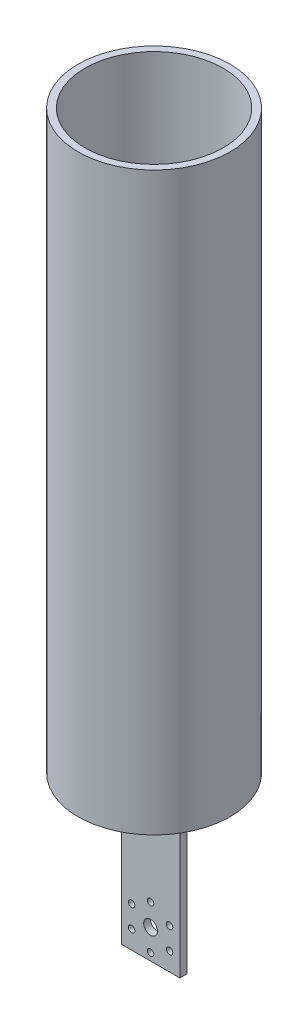
ISO-10303-21;
HEADER;
FILE_DESCRIPTION(('STEP AP214'),'2;1');
FILE_NAME('part.step','',(''),(''),'','','');
FILE_SCHEMA(('AUTOMOTIVE_DESIGN { 1 0 10303 214 1 1 1 1 }'));
ENDSEC;
DATA;
#1=APPLICATION_CONTEXT('core data for automotive mechanical design processes');
#2=APPLICATION_PROTOCOL_DEFINITION('international standard','automotive_design',2000,#1);
#3=PRODUCT_CONTEXT('',#1,'mechanical');
#4=PRODUCT('Part','Part','',(#3));
#5=PRODUCT_RELATED_PRODUCT_CATEGORY('part','',(#4));
#6=PRODUCT_DEFINITION_FORMATION('','',#4);
#7=PRODUCT_DEFINITION_CONTEXT('part definition',#1,'design');
#8=PRODUCT_DEFINITION('design','',#6,#7);
#9=PRODUCT_DEFINITION_SHAPE('','',#8);
#10=(LENGTH_UNIT() NAMED_UNIT(*) SI_UNIT(.MILLI.,.METRE.));
#11=(NAMED_UNIT(*) PLANE_ANGLE_UNIT() SI_UNIT($,.RADIAN.));
#12=(NAMED_UNIT(*) SI_UNIT($,.STERADIAN.) SOLID_ANGLE_UNIT());
#13=UNCERTAINTY_MEASURE_WITH_UNIT(LENGTH_MEASURE(1.E-05),#10,'distance_accuracy_value','');
#14=(GEOMETRIC_REPRESENTATION_CONTEXT(3) GLOBAL_UNCERTAINTY_ASSIGNED_CONTEXT((#13)) GLOBAL_UNIT_ASSIGNED_CONTEXT((#10,
#11,#12)) REPRESENTATION_CONTEXT('',''));
#15=CARTESIAN_POINT('',(0.,0.,0.));
#16=DIRECTION('',(0.,0.,1.));
#17=DIRECTION('',(1.,0.,0.));
#18=AXIS2_PLACEMENT_3D('',#15,#16,#17);
#19=CARTESIAN_POINT('',(25.4,70.,0.));
#20=DIRECTION('',(0.,0.,-1.));
#21=DIRECTION('',(0.,1.,0.));
#22=AXIS2_PLACEMENT_3D('',#19,#20,#21);
#23=PLANE('',#22);
#24=CARTESIAN_POINT('',(4.472758664048,17.4499999999997,0.));
#25=DIRECTION('',(0.,0.,1.));
#26=DIRECTION('',(1.,0.,0.));
#27=AXIS2_PLACEMENT_3D('',#24,#25,#26);
#28=CIRCLE('',#27,1.4);
#29=CARTESIAN_POINT('',(5.872758664048,17.4499999999997,0.));
#30=VERTEX_POINT('',#29);
#31=EDGE_CURVE('E142',#30,#30,#28,.T.);
#32=ORIENTED_EDGE('',*,*,#31,.F.);
#33=EDGE_LOOP('',(#32));
#34=FACE_BOUND('',#33,.T.);
#35=CARTESIAN_POINT('',(4.47275866404836,7.94999999999964,0.));
#36=DIRECTION('',(0.,0.,1.));
#37=DIRECTION('',(1.,0.,0.));
#38=AXIS2_PLACEMENT_3D('',#35,#36,#37);
#39=CIRCLE('',#38,1.4);
#40=CARTESIAN_POINT('',(5.87275866404836,7.94999999999964,0.));
#41=VERTEX_POINT('',#40);
#42=EDGE_CURVE('E146',#41,#41,#39,.T.);
#43=ORIENTED_EDGE('',*,*,#42,.F.);
#44=EDGE_LOOP('',(#43));
#45=FACE_BOUND('',#44,.T.);
#46=CARTESIAN_POINT('',(12.7000000000007,3.19999999999995,0.));
#47=DIRECTION('',(0.,0.,1.));
#48=DIRECTION('',(1.,0.,0.));
#49=AXIS2_PLACEMENT_3D('',#46,#47,#48);
#50=CIRCLE('',#49,1.4);
#51=CARTESIAN_POINT('',(14.1000000000007,3.19999999999995,0.));
#52=VERTEX_POINT('',#51);
#53=EDGE_CURVE('E150',#52,#52,#50,.T.);
#54=ORIENTED_EDGE('',*,*,#53,.F.);
#55=EDGE_LOOP('',(#54));
#56=FACE_BOUND('',#55,.T.);
#57=CARTESIAN_POINT('',(20.9272413359527,7.95000000000027,0.));
#58=DIRECTION('',(0.,0.,1.));
#59=DIRECTION('',(1.,0.,0.));
#60=AXIS2_PLACEMENT_3D('',#57,#58,#59);
#61=CIRCLE('',#60,1.4);
#62=CARTESIAN_POINT('',(22.3272413359527,7.95000000000027,0.));
#63=VERTEX_POINT('',#62);
#64=EDGE_CURVE('E154',#63,#63,#61,.T.);
#65=ORIENTED_EDGE('',*,*,#64,.F.);
#66=EDGE_LOOP('',(#65));
#67=FACE_BOUND('',#66,.T.);
#68=CARTESIAN_POINT('',(20.9272413359524,17.4500000000003,0.));
#69=DIRECTION('',(0.,0.,1.));
#70=DIRECTION('',(1.,0.,0.));
#71=AXIS2_PLACEMENT_3D('',#68,#69,#70);
#72=CIRCLE('',#71,1.4);
#73=CARTESIAN_POINT('',(22.3272413359524,17.4500000000003,0.));
#74=VERTEX_POINT('',#73);
#75=EDGE_CURVE('E158',#74,#74,#72,.T.);
#76=ORIENTED_EDGE('',*,*,#75,.F.);
#77=EDGE_LOOP('',(#76));
#78=FACE_BOUND('',#77,.T.);
#79=CARTESIAN_POINT('',(12.7,22.2,0.));
#80=DIRECTION('',(0.,0.,1.));
#81=DIRECTION('',(1.,0.,0.));
#82=AXIS2_PLACEMENT_3D('',#79,#80,#81);
#83=CIRCLE('',#82,1.4);
#84=CARTESIAN_POINT('',(14.1,22.2,0.));
#85=VERTEX_POINT('',#84);
#86=EDGE_CURVE('E162',#85,#85,#83,.T.);
#87=ORIENTED_EDGE('',*,*,#86,.F.);
#88=EDGE_LOOP('',(#87));
#89=FACE_BOUND('',#88,.T.);
#90=CARTESIAN_POINT('',(12.7,12.7,0.));
#91=DIRECTION('',(0.,0.,1.));
#92=DIRECTION('',(1.,0.,0.));
#93=AXIS2_PLACEMENT_3D('',#90,#91,#92);
#94=CIRCLE('',#93,3.);
#95=CARTESIAN_POINT('',(15.7,12.7,0.));
#96=VERTEX_POINT('',#95);
#97=EDGE_CURVE('E166',#96,#96,#94,.T.);
#98=ORIENTED_EDGE('',*,*,#97,.F.);
#99=EDGE_LOOP('',(#98));
#100=FACE_BOUND('',#99,.T.);
#101=DIRECTION('',(0.,-1.,0.));
#102=VECTOR('',#101,1.);
#103=CARTESIAN_POINT('',(42.6624765331573,320.,0.));
#104=LINE('',#103,#102);
#105=CARTESIAN_POINT('',(42.6624765331573,170.,0.));
#106=VERTEX_POINT('',#105);
#107=CARTESIAN_POINT('',(42.6624765331573,70.,0.));
#108=VERTEX_POINT('',#107);
#109=EDGE_CURVE('E119',#106,#108,#104,.T.);
#110=ORIENTED_EDGE('',*,*,#109,.F.);
#111=DIRECTION('',(1.,0.,0.));
#112=VECTOR('',#111,1.);
#113=CARTESIAN_POINT('',(-17.3,170.,0.));
#114=LINE('',#113,#112);
#115=CARTESIAN_POINT('',(-17.2624765331573,170.,0.));
#116=VERTEX_POINT('',#115);
#117=EDGE_CURVE('E127',#116,#106,#114,.T.);
#118=ORIENTED_EDGE('',*,*,#117,.F.);
#119=DIRECTION('',(0.,-1.,0.));
#120=VECTOR('',#119,1.);
#121=CARTESIAN_POINT('',(-17.2624765331573,320.,0.));
#122=LINE('',#121,#120);
#123=CARTESIAN_POINT('',(-17.2624765331573,70.,0.));
#124=VERTEX_POINT('',#123);
#125=EDGE_CURVE('E300',#124,#116,#122,.F.);
#126=ORIENTED_EDGE('',*,*,#125,.F.);
#127=DIRECTION('',(1.,0.,0.));
#128=VECTOR('',#127,1.);
#129=CARTESIAN_POINT('',(12.7,70.,0.));
#130=LINE('',#129,#128);
#131=CARTESIAN_POINT('',(0.,70.,0.));
#132=VERTEX_POINT('',#131);
#133=EDGE_CURVE('E39',#124,#132,#130,.T.);
#134=ORIENTED_EDGE('',*,*,#133,.T.);
#135=DIRECTION('',(0.,-1.,0.));
#136=VECTOR('',#135,1.);
#137=CARTESIAN_POINT('',(0.,70.,0.));
#138=LINE('',#137,#136);
#139=CARTESIAN_POINT('',(0.,0.,0.));
#140=VERTEX_POINT('',#139);
#141=EDGE_CURVE('E196',#132,#140,#138,.T.);
#142=ORIENTED_EDGE('',*,*,#141,.T.);
#143=DIRECTION('',(-1.,0.,0.));
#144=VECTOR('',#143,1.);
#145=CARTESIAN_POINT('',(25.4,0.,0.));
#146=LINE('',#145,#144);
#147=CARTESIAN_POINT('',(25.4,0.,0.));
#148=VERTEX_POINT('',#147);
#149=EDGE_CURVE('E11',#148,#140,#146,.T.);
#150=ORIENTED_EDGE('',*,*,#149,.F.);
#151=DIRECTION('',(0.,-1.,0.));
#152=VECTOR('',#151,1.);
#153=CARTESIAN_POINT('',(25.4,70.,0.));
#154=LINE('',#153,#152);
#155=CARTESIAN_POINT('',(25.4,70.,0.));
#156=VERTEX_POINT('',#155);
#157=EDGE_CURVE('E173',#156,#148,#154,.T.);
#158=ORIENTED_EDGE('',*,*,#157,.F.);
#159=EDGE_CURVE('E139',#156,#108,#130,.T.);
#160=ORIENTED_EDGE('',*,*,#159,.T.);
#161=EDGE_LOOP('',(#110,#118,#126,#134,#142,#150,#158,#160));
#162=FACE_BOUND('',#161,.T.);
#163=ADVANCED_FACE('F36',(#34,#45,#56,#67,#78,#89,#100,#162),#23,.F.);
#164=CARTESIAN_POINT('',(25.4,0.,-3.));
#165=DIRECTION('',(0.,0.,1.));
#166=DIRECTION('',(1.,0.,0.));
#167=AXIS2_PLACEMENT_3D('',#164,#165,#166);
#168=PLANE('',#167);
#169=CARTESIAN_POINT('',(4.472758664048,17.4499999999997,-3.));
#170=DIRECTION('',(0.,0.,1.));
#171=DIRECTION('',(1.,0.,0.));
#172=AXIS2_PLACEMENT_3D('',#169,#170,#171);
#173=CIRCLE('',#172,1.4);
#174=CARTESIAN_POINT('',(5.872758664048,17.4499999999997,-3.));
#175=VERTEX_POINT('',#174);
#176=EDGE_CURVE('E145',#175,#175,#173,.T.);
#177=ORIENTED_EDGE('',*,*,#176,.T.);
#178=EDGE_LOOP('',(#177));
#179=FACE_BOUND('',#178,.T.);
#180=CARTESIAN_POINT('',(4.47275866404836,7.94999999999964,-3.));
#181=DIRECTION('',(0.,0.,1.));
#182=DIRECTION('',(1.,0.,0.));
#183=AXIS2_PLACEMENT_3D('',#180,#181,#182);
#184=CIRCLE('',#183,1.4);
#185=CARTESIAN_POINT('',(5.87275866404836,7.94999999999964,-3.));
#186=VERTEX_POINT('',#185);
#187=EDGE_CURVE('E149',#186,#186,#184,.T.);
#188=ORIENTED_EDGE('',*,*,#187,.T.);
#189=EDGE_LOOP('',(#188));
#190=FACE_BOUND('',#189,.T.);
#191=CARTESIAN_POINT('',(12.7000000000007,3.19999999999995,-3.));
#192=DIRECTION('',(0.,0.,1.));
#193=DIRECTION('',(1.,0.,0.));
#194=AXIS2_PLACEMENT_3D('',#191,#192,#193);
#195=CIRCLE('',#194,1.4);
#196=CARTESIAN_POINT('',(14.1000000000007,3.19999999999995,-3.));
#197=VERTEX_POINT('',#196);
#198=EDGE_CURVE('E153',#197,#197,#195,.T.);
#199=ORIENTED_EDGE('',*,*,#198,.T.);
#200=EDGE_LOOP('',(#199));
#201=FACE_BOUND('',#200,.T.);
#202=CARTESIAN_POINT('',(20.9272413359527,7.95000000000027,-3.));
#203=DIRECTION('',(0.,0.,1.));
#204=DIRECTION('',(1.,0.,0.));
#205=AXIS2_PLACEMENT_3D('',#202,#203,#204);
#206=CIRCLE('',#205,1.4);
#207=CARTESIAN_POINT('',(22.3272413359527,7.95000000000027,-3.));
#208=VERTEX_POINT('',#207);
#209=EDGE_CURVE('E157',#208,#208,#206,.T.);
#210=ORIENTED_EDGE('',*,*,#209,.T.);
#211=EDGE_LOOP('',(#210));
#212=FACE_BOUND('',#211,.T.);
#213=CARTESIAN_POINT('',(20.9272413359524,17.4500000000003,-3.));
#214=DIRECTION('',(0.,0.,1.));
#215=DIRECTION('',(1.,0.,0.));
#216=AXIS2_PLACEMENT_3D('',#213,#214,#215);
#217=CIRCLE('',#216,1.4);
#218=CARTESIAN_POINT('',(22.3272413359524,17.4500000000003,-3.));
#219=VERTEX_POINT('',#218);
#220=EDGE_CURVE('E161',#219,#219,#217,.T.);
#221=ORIENTED_EDGE('',*,*,#220,.T.);
#222=EDGE_LOOP('',(#221));
#223=FACE_BOUND('',#222,.T.);
#224=CARTESIAN_POINT('',(12.7,22.2,-3.));
#225=DIRECTION('',(0.,0.,1.));
#226=DIRECTION('',(1.,0.,0.));
#227=AXIS2_PLACEMENT_3D('',#224,#225,#226);
#228=CIRCLE('',#227,1.4);
#229=CARTESIAN_POINT('',(14.1,22.2,-3.));
#230=VERTEX_POINT('',#229);
#231=EDGE_CURVE('E165',#230,#230,#228,.T.);
#232=ORIENTED_EDGE('',*,*,#231,.T.);
#233=EDGE_LOOP('',(#232));
#234=FACE_BOUND('',#233,.T.);
#235=CARTESIAN_POINT('',(12.7,12.7,-3.));
#236=DIRECTION('',(0.,0.,1.));
#237=DIRECTION('',(1.,0.,0.));
#238=AXIS2_PLACEMENT_3D('',#235,#236,#237);
#239=CIRCLE('',#238,3.);
#240=CARTESIAN_POINT('',(15.7,12.7,-3.));
#241=VERTEX_POINT('',#240);
#242=EDGE_CURVE('E169',#241,#241,#239,.T.);
#243=ORIENTED_EDGE('',*,*,#242,.T.);
#244=EDGE_LOOP('',(#243));
#245=FACE_BOUND('',#244,.T.);
#246=DIRECTION('',(0.,-1.,0.));
#247=VECTOR('',#246,1.);
#248=CARTESIAN_POINT('',(-17.2624765331573,320.,-3.));
#249=LINE('',#248,#247);
#250=CARTESIAN_POINT('',(-17.2624765331573,170.,-3.));
#251=VERTEX_POINT('',#250);
#252=CARTESIAN_POINT('',(-17.2624765331573,70.,-3.));
#253=VERTEX_POINT('',#252);
#254=EDGE_CURVE('E107',#251,#253,#249,.T.);
#255=ORIENTED_EDGE('',*,*,#254,.F.);
#256=DIRECTION('',(-1.,0.,0.));
#257=VECTOR('',#256,1.);
#258=CARTESIAN_POINT('',(42.7,170.,-3.));
#259=LINE('',#258,#257);
#260=CARTESIAN_POINT('',(42.6624765331573,170.,-3.));
#261=VERTEX_POINT('',#260);
#262=EDGE_CURVE('E118',#261,#251,#259,.T.);
#263=ORIENTED_EDGE('',*,*,#262,.F.);
#264=DIRECTION('',(0.,-1.,0.));
#265=VECTOR('',#264,1.);
#266=CARTESIAN_POINT('',(42.6624765331573,320.,-3.));
#267=LINE('',#266,#265);
#268=CARTESIAN_POINT('',(42.6624765331573,70.,-3.));
#269=VERTEX_POINT('',#268);
#270=EDGE_CURVE('E104',#269,#261,#267,.F.);
#271=ORIENTED_EDGE('',*,*,#270,.F.);
#272=DIRECTION('',(-1.,0.,0.));
#273=VECTOR('',#272,1.);
#274=CARTESIAN_POINT('',(42.7,70.,-3.));
#275=LINE('',#274,#273);
#276=CARTESIAN_POINT('',(25.4,70.,-3.));
#277=VERTEX_POINT('',#276);
#278=EDGE_CURVE('E116',#269,#277,#275,.T.);
#279=ORIENTED_EDGE('',*,*,#278,.T.);
#280=DIRECTION('',(0.,1.,0.));
#281=VECTOR('',#280,1.);
#282=CARTESIAN_POINT('',(25.4,0.,-3.));
#283=LINE('',#282,#281);
#284=CARTESIAN_POINT('',(25.4,0.,-3.));
#285=VERTEX_POINT('',#284);
#286=EDGE_CURVE('E172',#285,#277,#283,.T.);
#287=ORIENTED_EDGE('',*,*,#286,.F.);
#288=DIRECTION('',(-1.,0.,0.));
#289=VECTOR('',#288,1.);
#290=CARTESIAN_POINT('',(25.4,0.,-3.));
#291=LINE('',#290,#289);
#292=CARTESIAN_POINT('',(0.,0.,-3.));
#293=VERTEX_POINT('',#292);
#294=EDGE_CURVE('E45',#285,#293,#291,.T.);
#295=ORIENTED_EDGE('',*,*,#294,.T.);
#296=DIRECTION('',(0.,1.,0.));
#297=VECTOR('',#296,1.);
#298=CARTESIAN_POINT('',(0.,0.,-3.));
#299=LINE('',#298,#297);
#300=CARTESIAN_POINT('',(0.,70.,-3.));
#301=VERTEX_POINT('',#300);
#302=EDGE_CURVE('E190',#293,#301,#299,.T.);
#303=ORIENTED_EDGE('',*,*,#302,.T.);
#304=EDGE_CURVE('E128',#301,#253,#275,.T.);
#305=ORIENTED_EDGE('',*,*,#304,.T.);
#306=EDGE_LOOP('',(#255,#263,#271,#279,#287,#295,#303,#305));
#307=FACE_BOUND('',#306,.T.);
#308=ADVANCED_FACE('F114',(#179,#190,#201,#212,#223,#234,#245,#307),#168,.F.);
#309=CARTESIAN_POINT('',(0.,170.,0.));
#310=DIRECTION('',(0.,1.,0.));
#311=DIRECTION('',(0.,0.,1.));
#312=AXIS2_PLACEMENT_3D('',#309,#310,#311);
#313=PLANE('',#312);
#314=ORIENTED_EDGE('',*,*,#117,.T.);
#315=CARTESIAN_POINT('',(12.7,170.,-1.5));
#316=DIRECTION('',(0.,1.,0.));
#317=DIRECTION('',(0.,0.,1.));
#318=AXIS2_PLACEMENT_3D('',#315,#316,#317);
#319=CIRCLE('',#318,30.);
#320=EDGE_CURVE('E53',#106,#261,#319,.T.);
#321=ORIENTED_EDGE('',*,*,#320,.T.);
#322=ORIENTED_EDGE('',*,*,#262,.T.);
#323=EDGE_CURVE('E58',#251,#116,#319,.T.);
#324=ORIENTED_EDGE('',*,*,#323,.T.);
#325=EDGE_LOOP('',(#314,#321,#322,#324));
#326=FACE_BOUND('',#325,.T.);
#327=ADVANCED_FACE('F235',(#326),#313,.T.);
#328=CARTESIAN_POINT('',(25.4,0.,0.));
#329=DIRECTION('',(0.,1.,0.));
#330=DIRECTION('',(0.,0.,1.));
#331=AXIS2_PLACEMENT_3D('',#328,#329,#330);
#332=PLANE('',#331);
#333=DIRECTION('',(0.,0.,-1.));
#334=VECTOR('',#333,1.);
#335=CARTESIAN_POINT('',(0.,0.,0.));
#336=LINE('',#335,#334);
#337=EDGE_CURVE('E176',#140,#293,#336,.T.);
#338=ORIENTED_EDGE('',*,*,#337,.T.);
#339=ORIENTED_EDGE('',*,*,#294,.F.);
#340=DIRECTION('',(0.,0.,-1.));
#341=VECTOR('',#340,1.);
#342=CARTESIAN_POINT('',(25.4,0.,0.));
#343=LINE('',#342,#341);
#344=EDGE_CURVE('E170',#148,#285,#343,.T.);
#345=ORIENTED_EDGE('',*,*,#344,.F.);
#346=ORIENTED_EDGE('',*,*,#149,.T.);
#347=EDGE_LOOP('',(#338,#339,#345,#346));
#348=FACE_BOUND('',#347,.T.);
#349=ADVANCED_FACE('F260',(#348),#332,.F.);
#350=CARTESIAN_POINT('',(25.4,0.,0.));
#351=DIRECTION('',(1.,0.,0.));
#352=DIRECTION('',(0.,0.,-1.));
#353=AXIS2_PLACEMENT_3D('',#350,#351,#352);
#354=PLANE('',#353);
#355=ORIENTED_EDGE('',*,*,#157,.T.);
#356=ORIENTED_EDGE('',*,*,#344,.T.);
#357=ORIENTED_EDGE('',*,*,#286,.T.);
#358=DIRECTION('',(0.,0.,1.));
#359=VECTOR('',#358,1.);
#360=CARTESIAN_POINT('',(25.4,70.,-3.));
#361=LINE('',#360,#359);
#362=EDGE_CURVE('E125',#277,#156,#361,.T.);
#363=ORIENTED_EDGE('',*,*,#362,.T.);
#364=EDGE_LOOP('',(#355,#356,#357,#363));
#365=FACE_BOUND('',#364,.T.);
#366=ADVANCED_FACE('F265',(#365),#354,.T.);
#367=CARTESIAN_POINT('',(0.,0.,0.));
#368=DIRECTION('',(1.,0.,0.));
#369=DIRECTION('',(0.,0.,-1.));
#370=AXIS2_PLACEMENT_3D('',#367,#368,#369);
#371=PLANE('',#370);
#372=ORIENTED_EDGE('',*,*,#141,.F.);
#373=DIRECTION('',(0.,0.,1.));
#374=VECTOR('',#373,1.);
#375=CARTESIAN_POINT('',(0.,70.,-3.));
#376=LINE('',#375,#374);
#377=EDGE_CURVE('E184',#301,#132,#376,.T.);
#378=ORIENTED_EDGE('',*,*,#377,.F.);
#379=ORIENTED_EDGE('',*,*,#302,.F.);
#380=ORIENTED_EDGE('',*,*,#337,.F.);
#381=EDGE_LOOP('',(#372,#378,#379,#380));
#382=FACE_BOUND('',#381,.T.);
#383=ADVANCED_FACE('F307',(#382),#371,.F.);
#384=CARTESIAN_POINT('',(12.7,12.7,-25.4));
#385=DIRECTION('',(0.,0.,1.));
#386=DIRECTION('',(1.,0.,0.));
#387=AXIS2_PLACEMENT_3D('',#384,#385,#386);
#388=CYLINDRICAL_SURFACE('',#387,3.);
#389=ORIENTED_EDGE('',*,*,#97,.T.);
#390=EDGE_LOOP('',(#389));
#391=FACE_BOUND('',#390,.T.);
#392=ORIENTED_EDGE('',*,*,#242,.F.);
#393=EDGE_LOOP('',(#392));
#394=FACE_BOUND('',#393,.T.);
#395=ADVANCED_FACE('F316',(#391,#394),#388,.F.);
#396=CARTESIAN_POINT('',(12.7,22.2,-25.4));
#397=DIRECTION('',(0.,0.,1.));
#398=DIRECTION('',(1.,0.,0.));
#399=AXIS2_PLACEMENT_3D('',#396,#397,#398);
#400=CYLINDRICAL_SURFACE('',#399,1.4);
#401=ORIENTED_EDGE('',*,*,#86,.T.);
#402=EDGE_LOOP('',(#401));
#403=FACE_BOUND('',#402,.T.);
#404=ORIENTED_EDGE('',*,*,#231,.F.);
#405=EDGE_LOOP('',(#404));
#406=FACE_BOUND('',#405,.T.);
#407=ADVANCED_FACE('F321',(#403,#406),#400,.F.);
#408=CARTESIAN_POINT('',(20.9272413359524,17.4500000000003,-25.4));
#409=DIRECTION('',(0.,0.,1.));
#410=DIRECTION('',(1.,0.,0.));
#411=AXIS2_PLACEMENT_3D('',#408,#409,#410);
#412=CYLINDRICAL_SURFACE('',#411,1.4);
#413=ORIENTED_EDGE('',*,*,#75,.T.);
#414=EDGE_LOOP('',(#413));
#415=FACE_BOUND('',#414,.T.);
#416=ORIENTED_EDGE('',*,*,#220,.F.);
#417=EDGE_LOOP('',(#416));
#418=FACE_BOUND('',#417,.T.);
#419=ADVANCED_FACE('F325',(#415,#418),#412,.F.);
#420=CARTESIAN_POINT('',(20.9272413359527,7.95000000000027,-25.4));
#421=DIRECTION('',(0.,0.,1.));
#422=DIRECTION('',(1.,0.,0.));
#423=AXIS2_PLACEMENT_3D('',#420,#421,#422);
#424=CYLINDRICAL_SURFACE('',#423,1.4);
#425=ORIENTED_EDGE('',*,*,#64,.T.);
#426=EDGE_LOOP('',(#425));
#427=FACE_BOUND('',#426,.T.);
#428=ORIENTED_EDGE('',*,*,#209,.F.);
#429=EDGE_LOOP('',(#428));
#430=FACE_BOUND('',#429,.T.);
#431=ADVANCED_FACE('F227',(#427,#430),#424,.F.);
#432=CARTESIAN_POINT('',(12.7000000000007,3.19999999999995,-25.4));
#433=DIRECTION('',(0.,0.,1.));
#434=DIRECTION('',(1.,0.,0.));
#435=AXIS2_PLACEMENT_3D('',#432,#433,#434);
#436=CYLINDRICAL_SURFACE('',#435,1.4);
#437=ORIENTED_EDGE('',*,*,#53,.T.);
#438=EDGE_LOOP('',(#437));
#439=FACE_BOUND('',#438,.T.);
#440=ORIENTED_EDGE('',*,*,#198,.F.);
#441=EDGE_LOOP('',(#440));
#442=FACE_BOUND('',#441,.T.);
#443=ADVANCED_FACE('F218',(#439,#442),#436,.F.);
#444=CARTESIAN_POINT('',(4.47275866404836,7.94999999999964,-25.4));
#445=DIRECTION('',(0.,0.,1.));
#446=DIRECTION('',(1.,0.,0.));
#447=AXIS2_PLACEMENT_3D('',#444,#445,#446);
#448=CYLINDRICAL_SURFACE('',#447,1.4);
#449=ORIENTED_EDGE('',*,*,#42,.T.);
#450=EDGE_LOOP('',(#449));
#451=FACE_BOUND('',#450,.T.);
#452=ORIENTED_EDGE('',*,*,#187,.F.);
#453=EDGE_LOOP('',(#452));
#454=FACE_BOUND('',#453,.T.);
#455=ADVANCED_FACE('F215',(#451,#454),#448,.F.);
#456=CARTESIAN_POINT('',(4.472758664048,17.4499999999997,-25.4));
#457=DIRECTION('',(0.,0.,1.));
#458=DIRECTION('',(1.,0.,0.));
#459=AXIS2_PLACEMENT_3D('',#456,#457,#458);
#460=CYLINDRICAL_SURFACE('',#459,1.4);
#461=ORIENTED_EDGE('',*,*,#31,.T.);
#462=EDGE_LOOP('',(#461));
#463=FACE_BOUND('',#462,.T.);
#464=ORIENTED_EDGE('',*,*,#176,.F.);
#465=EDGE_LOOP('',(#464));
#466=FACE_BOUND('',#465,.T.);
#467=ADVANCED_FACE('F217',(#463,#466),#460,.F.);
#468=CARTESIAN_POINT('',(0.,70.,0.));
#469=DIRECTION('',(0.,1.,0.));
#470=DIRECTION('',(0.,0.,1.));
#471=AXIS2_PLACEMENT_3D('',#468,#469,#470);
#472=PLANE('',#471);
#473=ORIENTED_EDGE('',*,*,#133,.F.);
#474=CARTESIAN_POINT('',(12.7,70.,-1.5));
#475=DIRECTION('',(0.,-1.,0.));
#476=DIRECTION('',(0.,0.,-1.));
#477=AXIS2_PLACEMENT_3D('',#474,#475,#476);
#478=CIRCLE('',#477,30.);
#479=EDGE_CURVE('E111',#108,#124,#478,.T.);
#480=ORIENTED_EDGE('',*,*,#479,.F.);
#481=ORIENTED_EDGE('',*,*,#159,.F.);
#482=ORIENTED_EDGE('',*,*,#362,.F.);
#483=ORIENTED_EDGE('',*,*,#278,.F.);
#484=EDGE_CURVE('E101',#253,#269,#478,.T.);
#485=ORIENTED_EDGE('',*,*,#484,.F.);
#486=ORIENTED_EDGE('',*,*,#304,.F.);
#487=ORIENTED_EDGE('',*,*,#377,.T.);
#488=EDGE_LOOP('',(#473,#480,#481,#482,#483,#485,#486,#487));
#489=FACE_BOUND('',#488,.T.);
#490=CARTESIAN_POINT('',(12.7,70.,-1.5));
#491=DIRECTION('',(0.,-1.,0.));
#492=DIRECTION('',(0.,0.,-1.));
#493=AXIS2_PLACEMENT_3D('',#490,#491,#492);
#494=CIRCLE('',#493,33.);
#495=CARTESIAN_POINT('',(12.7,70.,-34.5));
#496=VERTEX_POINT('',#495);
#497=EDGE_CURVE('E293',#496,#496,#494,.T.);
#498=ORIENTED_EDGE('',*,*,#497,.T.);
#499=EDGE_LOOP('',(#498));
#500=FACE_BOUND('',#499,.T.);
#501=ADVANCED_FACE('F122',(#489,#500),#472,.F.);
#502=CARTESIAN_POINT('',(12.7,320.,-1.5));
#503=DIRECTION('',(0.,-1.,0.));
#504=DIRECTION('',(0.,0.,-1.));
#505=AXIS2_PLACEMENT_3D('',#502,#503,#504);
#506=CYLINDRICAL_SURFACE('',#505,30.);
#507=CARTESIAN_POINT('',(12.7,320.,-1.5));
#508=DIRECTION('',(0.,-1.,0.));
#509=DIRECTION('',(0.,0.,-1.));
#510=AXIS2_PLACEMENT_3D('',#507,#508,#509);
#511=CIRCLE('',#510,30.);
#512=CARTESIAN_POINT('',(12.7,320.,-31.5));
#513=VERTEX_POINT('',#512);
#514=EDGE_CURVE('E289',#513,#513,#511,.T.);
#515=ORIENTED_EDGE('',*,*,#514,.F.);
#516=EDGE_LOOP('',(#515));
#517=FACE_BOUND('',#516,.T.);
#518=ORIENTED_EDGE('',*,*,#320,.F.);
#519=ORIENTED_EDGE('',*,*,#109,.T.);
#520=ORIENTED_EDGE('',*,*,#479,.T.);
#521=ORIENTED_EDGE('',*,*,#125,.T.);
#522=ORIENTED_EDGE('',*,*,#323,.F.);
#523=ORIENTED_EDGE('',*,*,#254,.T.);
#524=ORIENTED_EDGE('',*,*,#484,.T.);
#525=ORIENTED_EDGE('',*,*,#270,.T.);
#526=EDGE_LOOP('',(#518,#519,#520,#521,#522,#523,#524,#525));
#527=FACE_BOUND('',#526,.T.);
#528=ADVANCED_FACE('F103',(#517,#527),#506,.F.);
#529=CARTESIAN_POINT('',(12.7,320.,-1.5));
#530=DIRECTION('',(0.,-1.,0.));
#531=DIRECTION('',(0.,0.,-1.));
#532=AXIS2_PLACEMENT_3D('',#529,#530,#531);
#533=CYLINDRICAL_SURFACE('',#532,33.);
#534=CARTESIAN_POINT('',(12.7,320.,-1.5));
#535=DIRECTION('',(0.,-1.,0.));
#536=DIRECTION('',(0.,0.,-1.));
#537=AXIS2_PLACEMENT_3D('',#534,#535,#536);
#538=CIRCLE('',#537,33.);
#539=CARTESIAN_POINT('',(12.7,320.,-34.5));
#540=VERTEX_POINT('',#539);
#541=EDGE_CURVE('E292',#540,#540,#538,.T.);
#542=ORIENTED_EDGE('',*,*,#541,.T.);
#543=EDGE_LOOP('',(#542));
#544=FACE_BOUND('',#543,.T.);
#545=ORIENTED_EDGE('',*,*,#497,.F.);
#546=EDGE_LOOP('',(#545));
#547=FACE_BOUND('',#546,.T.);
#548=ADVANCED_FACE('F269',(#544,#547),#533,.T.);
#549=CARTESIAN_POINT('',(12.7,320.,-1.5));
#550=DIRECTION('',(0.,-1.,0.));
#551=DIRECTION('',(0.,0.,-1.));
#552=AXIS2_PLACEMENT_3D('',#549,#550,#551);
#553=PLANE('',#552);
#554=ORIENTED_EDGE('',*,*,#514,.T.);
#555=EDGE_LOOP('',(#554));
#556=FACE_BOUND('',#555,.T.);
#557=ORIENTED_EDGE('',*,*,#541,.F.);
#558=EDGE_LOOP('',(#557));
#559=FACE_BOUND('',#558,.T.);
#560=ADVANCED_FACE('F280',(#556,#559),#553,.F.);
#561=CLOSED_SHELL('',(#163,#308,#327,#349,#366,#383,#395,#407,#419,#431,#443,#455,#467,#501,
#528,#548,#560));
#562=MANIFOLD_SOLID_BREP('B2',#561);
#563=ADVANCED_BREP_SHAPE_REPRESENTATION('',(#18,#562),#14);
#564=SHAPE_DEFINITION_REPRESENTATION(#9,#563);
ENDSEC;
END-ISO-10303-21;
